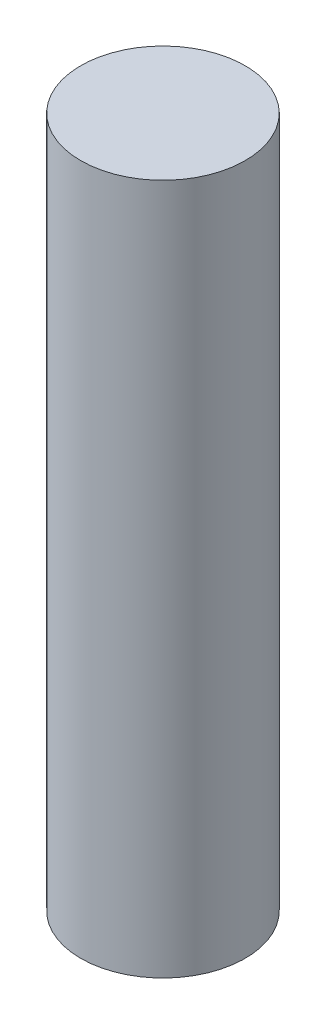
ISO-10303-21;
HEADER;
FILE_DESCRIPTION(('STEP AP214'),'2;1');
FILE_NAME('part.step','',(''),(''),'','','');
FILE_SCHEMA(('AUTOMOTIVE_DESIGN { 1 0 10303 214 1 1 1 1 }'));
ENDSEC;
DATA;
#1=APPLICATION_CONTEXT('core data for automotive mechanical design processes');
#2=APPLICATION_PROTOCOL_DEFINITION('international standard','automotive_design',2000,#1);
#3=PRODUCT_CONTEXT('',#1,'mechanical');
#4=PRODUCT('Part','Part','',(#3));
#5=PRODUCT_RELATED_PRODUCT_CATEGORY('part','',(#4));
#6=PRODUCT_DEFINITION_FORMATION('','',#4);
#7=PRODUCT_DEFINITION_CONTEXT('part definition',#1,'design');
#8=PRODUCT_DEFINITION('design','',#6,#7);
#9=PRODUCT_DEFINITION_SHAPE('','',#8);
#10=(LENGTH_UNIT() NAMED_UNIT(*) SI_UNIT(.MILLI.,.METRE.));
#11=(NAMED_UNIT(*) PLANE_ANGLE_UNIT() SI_UNIT($,.RADIAN.));
#12=(NAMED_UNIT(*) SI_UNIT($,.STERADIAN.) SOLID_ANGLE_UNIT());
#13=UNCERTAINTY_MEASURE_WITH_UNIT(LENGTH_MEASURE(1.E-05),#10,'distance_accuracy_value','');
#14=(GEOMETRIC_REPRESENTATION_CONTEXT(3) GLOBAL_UNCERTAINTY_ASSIGNED_CONTEXT((#13)) GLOBAL_UNIT_ASSIGNED_CONTEXT((#10,
#11,#12)) REPRESENTATION_CONTEXT('',''));
#15=CARTESIAN_POINT('',(0.,0.,0.));
#16=DIRECTION('',(0.,0.,1.));
#17=DIRECTION('',(1.,0.,0.));
#18=AXIS2_PLACEMENT_3D('',#15,#16,#17);
#19=CARTESIAN_POINT('',(0.,63.,0.));
#20=DIRECTION('',(0.,-1.,0.));
#21=DIRECTION('',(0.,0.,-1.));
#22=AXIS2_PLACEMENT_3D('',#19,#20,#21);
#23=CYLINDRICAL_SURFACE('',#22,7.5);
#24=CARTESIAN_POINT('',(0.,63.,0.));
#25=DIRECTION('',(0.,1.,0.));
#26=DIRECTION('',(0.,0.,1.));
#27=AXIS2_PLACEMENT_3D('',#24,#25,#26);
#28=CIRCLE('',#27,7.5);
#29=CARTESIAN_POINT('',(0.,63.,7.5));
#30=VERTEX_POINT('',#29);
#31=EDGE_CURVE('E10',#30,#30,#28,.T.);
#32=ORIENTED_EDGE('',*,*,#31,.F.);
#33=EDGE_LOOP('',(#32));
#34=FACE_BOUND('',#33,.T.);
#35=CARTESIAN_POINT('',(0.,0.,0.));
#36=DIRECTION('',(0.,1.,0.));
#37=DIRECTION('',(0.,0.,1.));
#38=AXIS2_PLACEMENT_3D('',#35,#36,#37);
#39=CIRCLE('',#38,7.5);
#40=CARTESIAN_POINT('',(0.,0.,7.5));
#41=VERTEX_POINT('',#40);
#42=EDGE_CURVE('E44',#41,#41,#39,.T.);
#43=ORIENTED_EDGE('',*,*,#42,.T.);
#44=EDGE_LOOP('',(#43));
#45=FACE_BOUND('',#44,.T.);
#46=ADVANCED_FACE('F41',(#34,#45),#23,.T.);
#47=CARTESIAN_POINT('',(0.,63.,0.));
#48=DIRECTION('',(0.,1.,0.));
#49=DIRECTION('',(0.,0.,1.));
#50=AXIS2_PLACEMENT_3D('',#47,#48,#49);
#51=PLANE('',#50);
#52=ORIENTED_EDGE('',*,*,#31,.T.);
#53=EDGE_LOOP('',(#52));
#54=FACE_BOUND('',#53,.T.);
#55=ADVANCED_FACE('F58',(#54),#51,.T.);
#56=CARTESIAN_POINT('',(0.,0.,0.));
#57=DIRECTION('',(0.,1.,0.));
#58=DIRECTION('',(0.,0.,1.));
#59=AXIS2_PLACEMENT_3D('',#56,#57,#58);
#60=PLANE('',#59);
#61=ORIENTED_EDGE('',*,*,#42,.F.);
#62=EDGE_LOOP('',(#61));
#63=FACE_BOUND('',#62,.T.);
#64=ADVANCED_FACE('F56',(#63),#60,.F.);
#65=CLOSED_SHELL('',(#46,#55,#64));
#66=MANIFOLD_SOLID_BREP('B2',#65);
#67=ADVANCED_BREP_SHAPE_REPRESENTATION('',(#18,#66),#14);
#68=SHAPE_DEFINITION_REPRESENTATION(#9,#67);
ENDSEC;
END-ISO-10303-21;
